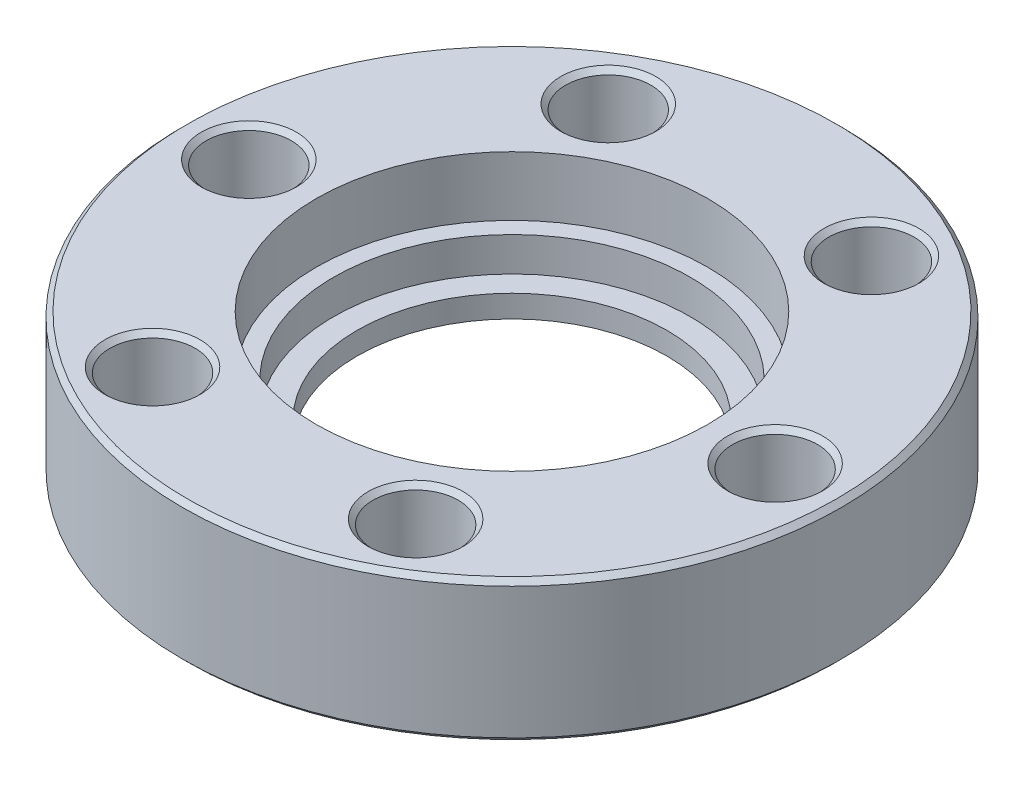
ISO-10303-21;
HEADER;
FILE_DESCRIPTION(('STEP AP214'),'2;1');
FILE_NAME('part.step','',(''),(''),'','','');
FILE_SCHEMA(('AUTOMOTIVE_DESIGN { 1 0 10303 214 1 1 1 1 }'));
ENDSEC;
DATA;
#1=APPLICATION_CONTEXT('core data for automotive mechanical design processes');
#2=APPLICATION_PROTOCOL_DEFINITION('international standard','automotive_design',2000,#1);
#3=PRODUCT_CONTEXT('',#1,'mechanical');
#4=PRODUCT('Part','Part','',(#3));
#5=PRODUCT_RELATED_PRODUCT_CATEGORY('part','',(#4));
#6=PRODUCT_DEFINITION_FORMATION('','',#4);
#7=PRODUCT_DEFINITION_CONTEXT('part definition',#1,'design');
#8=PRODUCT_DEFINITION('design','',#6,#7);
#9=PRODUCT_DEFINITION_SHAPE('','',#8);
#10=(LENGTH_UNIT() NAMED_UNIT(*) SI_UNIT(.MILLI.,.METRE.));
#11=(NAMED_UNIT(*) PLANE_ANGLE_UNIT() SI_UNIT($,.RADIAN.));
#12=(NAMED_UNIT(*) SI_UNIT($,.STERADIAN.) SOLID_ANGLE_UNIT());
#13=UNCERTAINTY_MEASURE_WITH_UNIT(LENGTH_MEASURE(1.E-05),#10,'distance_accuracy_value','');
#14=(GEOMETRIC_REPRESENTATION_CONTEXT(3) GLOBAL_UNCERTAINTY_ASSIGNED_CONTEXT((#13)) GLOBAL_UNIT_ASSIGNED_CONTEXT((#10,
#11,#12)) REPRESENTATION_CONTEXT('',''));
#15=CARTESIAN_POINT('',(0.,0.,0.));
#16=DIRECTION('',(0.,0.,1.));
#17=DIRECTION('',(1.,0.,0.));
#18=AXIS2_PLACEMENT_3D('',#15,#16,#17);
#19=CARTESIAN_POINT('',(0.,10.0543641033815,0.));
#20=DIRECTION('',(0.,1.,0.));
#21=DIRECTION('',(0.,0.,1.));
#22=AXIS2_PLACEMENT_3D('',#19,#20,#21);
#23=CYLINDRICAL_SURFACE('',#22,9.144);
#24=CARTESIAN_POINT('',(0.,1.29540000000001,0.));
#25=DIRECTION('',(0.,1.,0.));
#26=DIRECTION('',(0.,0.,1.));
#27=AXIS2_PLACEMENT_3D('',#24,#25,#26);
#28=CIRCLE('',#27,9.144);
#29=CARTESIAN_POINT('',(0.,1.29540000000001,9.144));
#30=VERTEX_POINT('',#29);
#31=EDGE_CURVE('E17',#30,#30,#28,.F.);
#32=ORIENTED_EDGE('',*,*,#31,.F.);
#33=EDGE_LOOP('',(#32));
#34=FACE_BOUND('',#33,.T.);
#35=CARTESIAN_POINT('',(0.,0.6604,0.));
#36=DIRECTION('',(0.,1.,0.));
#37=DIRECTION('',(0.,0.,1.));
#38=AXIS2_PLACEMENT_3D('',#35,#36,#37);
#39=CIRCLE('',#38,9.144);
#40=CARTESIAN_POINT('',(0.,0.6604,9.144));
#41=VERTEX_POINT('',#40);
#42=EDGE_CURVE('E29',#41,#41,#39,.T.);
#43=ORIENTED_EDGE('',*,*,#42,.F.);
#44=EDGE_LOOP('',(#43));
#45=FACE_BOUND('',#44,.T.);
#46=ADVANCED_FACE('F14',(#34,#45),#23,.F.);
#47=CARTESIAN_POINT('',(9.144,1.29540000000001,0.));
#48=DIRECTION('',(0.,-1.,0.));
#49=DIRECTION('',(0.,0.,-1.));
#50=AXIS2_PLACEMENT_3D('',#47,#48,#49);
#51=PLANE('',#50);
#52=ORIENTED_EDGE('',*,*,#31,.T.);
#53=EDGE_LOOP('',(#52));
#54=FACE_BOUND('',#53,.T.);
#55=CARTESIAN_POINT('',(0.,1.29540000000001,0.));
#56=DIRECTION('',(0.,1.,0.));
#57=DIRECTION('',(0.,0.,1.));
#58=AXIS2_PLACEMENT_3D('',#55,#56,#57);
#59=CIRCLE('',#58,7.9375);
#60=CARTESIAN_POINT('',(0.,1.29540000000001,7.9375));
#61=VERTEX_POINT('',#60);
#62=EDGE_CURVE('E90',#61,#61,#59,.T.);
#63=ORIENTED_EDGE('',*,*,#62,.T.);
#64=EDGE_LOOP('',(#63));
#65=FACE_BOUND('',#64,.T.);
#66=ADVANCED_FACE('F101',(#54,#65),#51,.T.);
#67=CARTESIAN_POINT('',(0.,1.23358032492243,0.));
#68=DIRECTION('',(0.,1.,0.));
#69=DIRECTION('',(0.,0.,1.));
#70=AXIS2_PLACEMENT_3D('',#67,#68,#69);
#71=CONICAL_SURFACE('',#70,10.7188,1.22173047639602);
#72=ORIENTED_EDGE('',*,*,#42,.T.);
#73=EDGE_LOOP('',(#72));
#74=FACE_BOUND('',#73,.T.);
#75=CARTESIAN_POINT('',(0.,1.23358032492243,0.));
#76=DIRECTION('',(0.,1.,0.));
#77=DIRECTION('',(0.,0.,1.));
#78=AXIS2_PLACEMENT_3D('',#75,#76,#77);
#79=CIRCLE('',#78,10.7188);
#80=CARTESIAN_POINT('',(0.,1.23358032492243,10.7188));
#81=VERTEX_POINT('',#80);
#82=EDGE_CURVE('E89',#81,#81,#79,.F.);
#83=ORIENTED_EDGE('',*,*,#82,.T.);
#84=EDGE_LOOP('',(#83));
#85=FACE_BOUND('',#84,.T.);
#86=ADVANCED_FACE('F109',(#74,#85),#71,.T.);
#87=CARTESIAN_POINT('',(0.,0.,0.));
#88=DIRECTION('',(0.,1.,0.));
#89=DIRECTION('',(0.,0.,1.));
#90=AXIS2_PLACEMENT_3D('',#87,#88,#89);
#91=CYLINDRICAL_SURFACE('',#90,7.9375);
#92=ORIENTED_EDGE('',*,*,#62,.F.);
#93=EDGE_LOOP('',(#92));
#94=FACE_BOUND('',#93,.T.);
#95=CARTESIAN_POINT('',(0.,2.4384,0.));
#96=DIRECTION('',(0.,1.,0.));
#97=DIRECTION('',(0.,0.,1.));
#98=AXIS2_PLACEMENT_3D('',#95,#96,#97);
#99=CIRCLE('',#98,7.9375);
#100=CARTESIAN_POINT('',(0.,2.4384,7.9375));
#101=VERTEX_POINT('',#100);
#102=EDGE_CURVE('E87',#101,#101,#99,.F.);
#103=ORIENTED_EDGE('',*,*,#102,.F.);
#104=EDGE_LOOP('',(#103));
#105=FACE_BOUND('',#104,.T.);
#106=ADVANCED_FACE('F224',(#94,#105),#91,.F.);
#107=CARTESIAN_POINT('',(0.,10.0543641033815,0.));
#108=DIRECTION('',(0.,1.,0.));
#109=DIRECTION('',(0.,0.,1.));
#110=AXIS2_PLACEMENT_3D('',#107,#108,#109);
#111=CYLINDRICAL_SURFACE('',#110,10.7188);
#112=ORIENTED_EDGE('',*,*,#82,.F.);
#113=EDGE_LOOP('',(#112));
#114=FACE_BOUND('',#113,.T.);
#115=CARTESIAN_POINT('',(0.,0.,0.));
#116=DIRECTION('',(0.,1.,0.));
#117=DIRECTION('',(0.,0.,1.));
#118=AXIS2_PLACEMENT_3D('',#115,#116,#117);
#119=CIRCLE('',#118,10.7188);
#120=CARTESIAN_POINT('',(0.,0.,10.7188));
#121=VERTEX_POINT('',#120);
#122=EDGE_CURVE('E84',#121,#121,#119,.T.);
#123=ORIENTED_EDGE('',*,*,#122,.F.);
#124=EDGE_LOOP('',(#123));
#125=FACE_BOUND('',#124,.T.);
#126=ADVANCED_FACE('F220',(#114,#125),#111,.F.);
#127=CARTESIAN_POINT('',(0.,2.4384,0.));
#128=DIRECTION('',(0.,1.,0.));
#129=DIRECTION('',(0.,0.,1.));
#130=AXIS2_PLACEMENT_3D('',#127,#128,#129);
#131=PLANE('',#130);
#132=ORIENTED_EDGE('',*,*,#102,.T.);
#133=EDGE_LOOP('',(#132));
#134=FACE_BOUND('',#133,.T.);
#135=CARTESIAN_POINT('',(0.,2.4384,0.));
#136=DIRECTION('',(0.,1.,0.));
#137=DIRECTION('',(0.,0.,1.));
#138=AXIS2_PLACEMENT_3D('',#135,#136,#137);
#139=CIRCLE('',#138,9.144);
#140=CARTESIAN_POINT('',(0.,2.4384,9.144));
#141=VERTEX_POINT('',#140);
#142=EDGE_CURVE('E63',#141,#141,#139,.T.);
#143=ORIENTED_EDGE('',*,*,#142,.T.);
#144=EDGE_LOOP('',(#143));
#145=FACE_BOUND('',#144,.T.);
#146=ADVANCED_FACE('F216',(#134,#145),#131,.T.);
#147=CARTESIAN_POINT('',(0.,0.,0.));
#148=DIRECTION('',(0.,-1.,0.));
#149=DIRECTION('',(0.,0.,-1.));
#150=AXIS2_PLACEMENT_3D('',#147,#148,#149);
#151=PLANE('',#150);
#152=ORIENTED_EDGE('',*,*,#122,.T.);
#153=EDGE_LOOP('',(#152));
#154=FACE_BOUND('',#153,.T.);
#155=CARTESIAN_POINT('',(0.,0.,0.));
#156=DIRECTION('',(0.,1.,0.));
#157=DIRECTION('',(0.,0.,1.));
#158=AXIS2_PLACEMENT_3D('',#155,#156,#157);
#159=CIRCLE('',#158,16.637);
#160=CARTESIAN_POINT('',(0.,0.,16.637));
#161=VERTEX_POINT('',#160);
#162=EDGE_CURVE('E59',#161,#161,#159,.T.);
#163=ORIENTED_EDGE('',*,*,#162,.F.);
#164=EDGE_LOOP('',(#163));
#165=FACE_BOUND('',#164,.T.);
#166=CARTESIAN_POINT('',(6.74370000000014,0.,-11.6804310310022));
#167=DIRECTION('',(0.,-1.,0.));
#168=DIRECTION('',(0.,0.,-1.));
#169=AXIS2_PLACEMENT_3D('',#166,#167,#168);
#170=CIRCLE('',#169,2.43839999999638);
#171=CARTESIAN_POINT('',(6.74370000000014,0.,-14.1188310309985));
#172=VERTEX_POINT('',#171);
#173=EDGE_CURVE('E78',#172,#172,#170,.F.);
#174=ORIENTED_EDGE('',*,*,#173,.T.);
#175=EDGE_LOOP('',(#174));
#176=FACE_BOUND('',#175,.T.);
#177=CARTESIAN_POINT('',(13.4874,-5.6843418860808E-11,0.));
#178=DIRECTION('',(0.,-1.,0.));
#179=DIRECTION('',(0.,0.,-1.));
#180=AXIS2_PLACEMENT_3D('',#177,#178,#179);
#181=CIRCLE('',#180,2.43840000001683);
#182=CARTESIAN_POINT('',(13.4874,-5.6843418860808E-11,-2.43840000001683));
#183=VERTEX_POINT('',#182);
#184=EDGE_CURVE('E75',#183,#183,#181,.F.);
#185=ORIENTED_EDGE('',*,*,#184,.T.);
#186=EDGE_LOOP('',(#185));
#187=FACE_BOUND('',#186,.T.);
#188=CARTESIAN_POINT('',(6.74369999999997,-5.6843418860808E-11,11.6804310310023));
#189=DIRECTION('',(0.,-1.,0.));
#190=DIRECTION('',(0.,0.,-1.));
#191=AXIS2_PLACEMENT_3D('',#188,#189,#190);
#192=CIRCLE('',#191,2.43840000003737);
#193=CARTESIAN_POINT('',(6.74369999999997,-5.6843418860808E-11,9.24203103096488));
#194=VERTEX_POINT('',#193);
#195=EDGE_CURVE('E72',#194,#194,#192,.F.);
#196=ORIENTED_EDGE('',*,*,#195,.T.);
#197=EDGE_LOOP('',(#196));
#198=FACE_BOUND('',#197,.T.);
#199=CARTESIAN_POINT('',(-6.74370000000005,5.6843418860808E-11,11.6804310310022));
#200=DIRECTION('',(0.,-1.,0.));
#201=DIRECTION('',(0.,0.,-1.));
#202=AXIS2_PLACEMENT_3D('',#199,#200,#201);
#203=CIRCLE('',#202,2.43839999998048);
#204=CARTESIAN_POINT('',(-6.74370000000005,5.6843418860808E-11,9.24203103102172));
#205=VERTEX_POINT('',#204);
#206=EDGE_CURVE('E69',#205,#205,#203,.F.);
#207=ORIENTED_EDGE('',*,*,#206,.T.);
#208=EDGE_LOOP('',(#207));
#209=FACE_BOUND('',#208,.T.);
#210=CARTESIAN_POINT('',(-13.4874,-5.6843418860808E-11,0.));
#211=DIRECTION('',(0.,-1.,0.));
#212=DIRECTION('',(0.,0.,-1.));
#213=AXIS2_PLACEMENT_3D('',#210,#211,#212);
#214=CIRCLE('',#213,2.43840000001673);
#215=CARTESIAN_POINT('',(-13.4874,-5.6843418860808E-11,-2.43840000001683));
#216=VERTEX_POINT('',#215);
#217=EDGE_CURVE('E66',#216,#216,#214,.F.);
#218=ORIENTED_EDGE('',*,*,#217,.T.);
#219=EDGE_LOOP('',(#218));
#220=FACE_BOUND('',#219,.T.);
#221=CARTESIAN_POINT('',(-6.74369999999989,5.6843418860808E-11,-11.6804310310023));
#222=DIRECTION('',(0.,-1.,0.));
#223=DIRECTION('',(0.,0.,-1.));
#224=AXIS2_PLACEMENT_3D('',#221,#222,#223);
#225=CIRCLE('',#224,2.43839999993939);
#226=CARTESIAN_POINT('',(-6.74369999999989,5.6843418860808E-11,-14.1188310309417));
#227=VERTEX_POINT('',#226);
#228=EDGE_CURVE('E81',#227,#227,#225,.F.);
#229=ORIENTED_EDGE('',*,*,#228,.T.);
#230=EDGE_LOOP('',(#229));
#231=FACE_BOUND('',#230,.T.);
#232=ADVANCED_FACE('F212',(#154,#165,#176,#187,#198,#209,#220,#231),#151,.T.);
#233=CARTESIAN_POINT('',(-6.74369999999989,1.13686837721616E-10,-11.6804310310023));
#234=DIRECTION('',(0.,-1.,0.));
#235=DIRECTION('',(0.,0.,-1.));
#236=AXIS2_PLACEMENT_3D('',#233,#234,#235);
#237=CONICAL_SURFACE('',#236,2.43839999988255,0.785398163397448);
#238=CARTESIAN_POINT('',(-6.74369999999989,0.254,-11.6804310310023));
#239=DIRECTION('',(0.,1.,0.));
#240=DIRECTION('',(0.,0.,1.));
#241=AXIS2_PLACEMENT_3D('',#238,#239,#240);
#242=CIRCLE('',#241,2.1844);
#243=CARTESIAN_POINT('',(-6.74369999999989,0.254,-9.4960310310023));
#244=VERTEX_POINT('',#243);
#245=EDGE_CURVE('E62',#244,#244,#242,.T.);
#246=ORIENTED_EDGE('',*,*,#245,.T.);
#247=EDGE_LOOP('',(#246));
#248=FACE_BOUND('',#247,.T.);
#249=ORIENTED_EDGE('',*,*,#228,.F.);
#250=EDGE_LOOP('',(#249));
#251=FACE_BOUND('',#250,.T.);
#252=ADVANCED_FACE('F208',(#248,#251),#237,.F.);
#253=CARTESIAN_POINT('',(6.74370000000014,0.,-11.6804310310022));
#254=DIRECTION('',(0.,-1.,0.));
#255=DIRECTION('',(0.,0.,-1.));
#256=AXIS2_PLACEMENT_3D('',#253,#254,#255);
#257=CONICAL_SURFACE('',#256,2.43839999999638,0.785398163397448);
#258=CARTESIAN_POINT('',(6.74370000000014,0.254000000000007,-11.6804310310022));
#259=DIRECTION('',(0.,1.,0.));
#260=DIRECTION('',(0.,0.,1.));
#261=AXIS2_PLACEMENT_3D('',#258,#259,#260);
#262=CIRCLE('',#261,2.1844);
#263=CARTESIAN_POINT('',(6.74370000000014,0.254000000000007,-9.49603103100216));
#264=VERTEX_POINT('',#263);
#265=EDGE_CURVE('E395',#264,#264,#262,.T.);
#266=ORIENTED_EDGE('',*,*,#265,.T.);
#267=EDGE_LOOP('',(#266));
#268=FACE_BOUND('',#267,.T.);
#269=ORIENTED_EDGE('',*,*,#173,.F.);
#270=EDGE_LOOP('',(#269));
#271=FACE_BOUND('',#270,.T.);
#272=ADVANCED_FACE('F204',(#268,#271),#257,.F.);
#273=CARTESIAN_POINT('',(13.4874,5.6843418860808E-11,0.));
#274=DIRECTION('',(0.,-1.,0.));
#275=DIRECTION('',(0.,0.,-1.));
#276=AXIS2_PLACEMENT_3D('',#273,#274,#275);
#277=CONICAL_SURFACE('',#276,2.43839999990314,0.785398163397448);
#278=CARTESIAN_POINT('',(13.4874,0.253999999999999,0.));
#279=DIRECTION('',(0.,1.,0.));
#280=DIRECTION('',(0.,0.,1.));
#281=AXIS2_PLACEMENT_3D('',#278,#279,#280);
#282=CIRCLE('',#281,2.1844);
#283=CARTESIAN_POINT('',(13.4874,0.253999999999999,2.1844));
#284=VERTEX_POINT('',#283);
#285=EDGE_CURVE('E398',#284,#284,#282,.T.);
#286=ORIENTED_EDGE('',*,*,#285,.T.);
#287=EDGE_LOOP('',(#286));
#288=FACE_BOUND('',#287,.T.);
#289=ORIENTED_EDGE('',*,*,#184,.F.);
#290=EDGE_LOOP('',(#289));
#291=FACE_BOUND('',#290,.T.);
#292=ADVANCED_FACE('F200',(#288,#291),#277,.F.);
#293=CARTESIAN_POINT('',(6.74369999999997,-1.13686837721616E-10,11.6804310310023));
#294=DIRECTION('',(0.,-1.,0.));
#295=DIRECTION('',(0.,0.,-1.));
#296=AXIS2_PLACEMENT_3D('',#293,#294,#295);
#297=CONICAL_SURFACE('',#296,2.43840000009422,0.785398163397448);
#298=CARTESIAN_POINT('',(6.74369999999997,0.253999999999986,11.6804310310023));
#299=DIRECTION('',(0.,1.,0.));
#300=DIRECTION('',(0.,0.,1.));
#301=AXIS2_PLACEMENT_3D('',#298,#299,#300);
#302=CIRCLE('',#301,2.1844);
#303=CARTESIAN_POINT('',(6.74369999999997,0.253999999999986,13.8648310310023));
#304=VERTEX_POINT('',#303);
#305=EDGE_CURVE('E403',#304,#304,#302,.T.);
#306=ORIENTED_EDGE('',*,*,#305,.T.);
#307=EDGE_LOOP('',(#306));
#308=FACE_BOUND('',#307,.T.);
#309=ORIENTED_EDGE('',*,*,#195,.F.);
#310=EDGE_LOOP('',(#309));
#311=FACE_BOUND('',#310,.T.);
#312=ADVANCED_FACE('F196',(#308,#311),#297,.F.);
#313=CARTESIAN_POINT('',(-6.74370000000005,1.13686837721616E-10,11.6804310310022));
#314=DIRECTION('',(0.,-1.,0.));
#315=DIRECTION('',(0.,0.,-1.));
#316=AXIS2_PLACEMENT_3D('',#313,#314,#315);
#317=CONICAL_SURFACE('',#316,2.43839999992364,0.785398163397448);
#318=CARTESIAN_POINT('',(-6.74370000000005,0.253999999999987,11.6804310310022));
#319=DIRECTION('',(0.,1.,0.));
#320=DIRECTION('',(0.,0.,1.));
#321=AXIS2_PLACEMENT_3D('',#318,#319,#320);
#322=CIRCLE('',#321,2.1844);
#323=CARTESIAN_POINT('',(-6.74370000000005,0.253999999999987,13.8648310310022));
#324=VERTEX_POINT('',#323);
#325=EDGE_CURVE('E406',#324,#324,#322,.T.);
#326=ORIENTED_EDGE('',*,*,#325,.T.);
#327=EDGE_LOOP('',(#326));
#328=FACE_BOUND('',#327,.T.);
#329=ORIENTED_EDGE('',*,*,#206,.F.);
#330=EDGE_LOOP('',(#329));
#331=FACE_BOUND('',#330,.T.);
#332=ADVANCED_FACE('F192',(#328,#331),#317,.F.);
#333=CARTESIAN_POINT('',(-13.4874,5.6843418860808E-11,0.));
#334=DIRECTION('',(0.,-1.,0.));
#335=DIRECTION('',(0.,0.,-1.));
#336=AXIS2_PLACEMENT_3D('',#333,#334,#335);
#337=CONICAL_SURFACE('',#336,2.43839999990305,0.785398163397448);
#338=CARTESIAN_POINT('',(-13.4874,0.253999999999999,0.));
#339=DIRECTION('',(0.,1.,0.));
#340=DIRECTION('',(0.,0.,1.));
#341=AXIS2_PLACEMENT_3D('',#338,#339,#340);
#342=CIRCLE('',#341,2.1844);
#343=CARTESIAN_POINT('',(-13.4874,0.253999999999999,2.18439999999991));
#344=VERTEX_POINT('',#343);
#345=EDGE_CURVE('E58',#344,#344,#342,.T.);
#346=ORIENTED_EDGE('',*,*,#345,.T.);
#347=EDGE_LOOP('',(#346));
#348=FACE_BOUND('',#347,.T.);
#349=ORIENTED_EDGE('',*,*,#217,.F.);
#350=EDGE_LOOP('',(#349));
#351=FACE_BOUND('',#350,.T.);
#352=ADVANCED_FACE('F188',(#348,#351),#337,.F.);
#353=CARTESIAN_POINT('',(0.,2.4384,0.));
#354=DIRECTION('',(0.,1.,0.));
#355=DIRECTION('',(0.,0.,1.));
#356=AXIS2_PLACEMENT_3D('',#353,#354,#355);
#357=CYLINDRICAL_SURFACE('',#356,9.144);
#358=ORIENTED_EDGE('',*,*,#142,.F.);
#359=EDGE_LOOP('',(#358));
#360=FACE_BOUND('',#359,.T.);
#361=CARTESIAN_POINT('',(0.,4.191,0.));
#362=DIRECTION('',(0.,1.,0.));
#363=DIRECTION('',(0.,0.,1.));
#364=AXIS2_PLACEMENT_3D('',#361,#362,#363);
#365=CIRCLE('',#364,9.144);
#366=CARTESIAN_POINT('',(0.,4.191,9.144));
#367=VERTEX_POINT('',#366);
#368=EDGE_CURVE('E54',#367,#367,#365,.F.);
#369=ORIENTED_EDGE('',*,*,#368,.F.);
#370=EDGE_LOOP('',(#369));
#371=FACE_BOUND('',#370,.T.);
#372=ADVANCED_FACE('F184',(#360,#371),#357,.F.);
#373=CARTESIAN_POINT('',(0.,0.254000000000004,0.));
#374=DIRECTION('',(0.,1.,0.));
#375=DIRECTION('',(0.,0.,1.));
#376=AXIS2_PLACEMENT_3D('',#373,#374,#375);
#377=CONICAL_SURFACE('',#376,16.891,0.785398163397449);
#378=CARTESIAN_POINT('',(0.,0.254000000000004,0.));
#379=DIRECTION('',(0.,1.,0.));
#380=DIRECTION('',(0.,0.,1.));
#381=AXIS2_PLACEMENT_3D('',#378,#379,#380);
#382=CIRCLE('',#381,16.891);
#383=CARTESIAN_POINT('',(0.,0.254000000000004,16.891));
#384=VERTEX_POINT('',#383);
#385=EDGE_CURVE('E57',#384,#384,#382,.T.);
#386=ORIENTED_EDGE('',*,*,#385,.F.);
#387=EDGE_LOOP('',(#386));
#388=FACE_BOUND('',#387,.T.);
#389=ORIENTED_EDGE('',*,*,#162,.T.);
#390=EDGE_LOOP('',(#389));
#391=FACE_BOUND('',#390,.T.);
#392=ADVANCED_FACE('F180',(#388,#391),#377,.T.);
#393=CARTESIAN_POINT('',(-6.74369999999989,0.,-11.6804310310023));
#394=DIRECTION('',(0.,1.,0.));
#395=DIRECTION('',(0.,0.,1.));
#396=AXIS2_PLACEMENT_3D('',#393,#394,#395);
#397=CYLINDRICAL_SURFACE('',#396,2.1844);
#398=ORIENTED_EDGE('',*,*,#245,.F.);
#399=EDGE_LOOP('',(#398));
#400=FACE_BOUND('',#399,.T.);
#401=CARTESIAN_POINT('',(-6.74369999999989,6.98499999998603,-11.6804310310023));
#402=DIRECTION('',(0.,1.,0.));
#403=DIRECTION('',(0.,0.,1.));
#404=AXIS2_PLACEMENT_3D('',#401,#402,#403);
#405=CIRCLE('',#404,2.18439999999659);
#406=CARTESIAN_POINT('',(-6.74369999999989,6.98499999998603,-9.49603103100571));
#407=VERTEX_POINT('',#406);
#408=EDGE_CURVE('E413',#407,#407,#405,.T.);
#409=ORIENTED_EDGE('',*,*,#408,.T.);
#410=EDGE_LOOP('',(#409));
#411=FACE_BOUND('',#410,.T.);
#412=ADVANCED_FACE('F176',(#400,#411),#397,.F.);
#413=CARTESIAN_POINT('',(6.74370000000014,0.,-11.6804310310022));
#414=DIRECTION('',(0.,1.,0.));
#415=DIRECTION('',(0.,0.,1.));
#416=AXIS2_PLACEMENT_3D('',#413,#414,#415);
#417=CYLINDRICAL_SURFACE('',#416,2.1844);
#418=ORIENTED_EDGE('',*,*,#265,.F.);
#419=EDGE_LOOP('',(#418));
#420=FACE_BOUND('',#419,.T.);
#421=CARTESIAN_POINT('',(6.74370000000014,6.98499999998603,-11.6804310310022));
#422=DIRECTION('',(0.,1.,0.));
#423=DIRECTION('',(0.,0.,1.));
#424=AXIS2_PLACEMENT_3D('',#421,#422,#423);
#425=CIRCLE('',#424,2.18439999999645);
#426=CARTESIAN_POINT('',(6.74370000000014,6.98499999998603,-9.49603103100571));
#427=VERTEX_POINT('',#426);
#428=EDGE_CURVE('E416',#427,#427,#425,.T.);
#429=ORIENTED_EDGE('',*,*,#428,.T.);
#430=EDGE_LOOP('',(#429));
#431=FACE_BOUND('',#430,.T.);
#432=ADVANCED_FACE('F172',(#420,#431),#417,.F.);
#433=CARTESIAN_POINT('',(13.4874,0.,0.));
#434=DIRECTION('',(0.,1.,0.));
#435=DIRECTION('',(0.,0.,1.));
#436=AXIS2_PLACEMENT_3D('',#433,#434,#435);
#437=CYLINDRICAL_SURFACE('',#436,2.1844);
#438=ORIENTED_EDGE('',*,*,#285,.F.);
#439=EDGE_LOOP('',(#438));
#440=FACE_BOUND('',#439,.T.);
#441=CARTESIAN_POINT('',(13.4874,6.98499999998603,0.));
#442=DIRECTION('',(0.,1.,0.));
#443=DIRECTION('',(0.,0.,1.));
#444=AXIS2_PLACEMENT_3D('',#441,#442,#443);
#445=CIRCLE('',#444,2.18439999991915);
#446=CARTESIAN_POINT('',(13.4874,6.98499999998603,2.18439999991915));
#447=VERTEX_POINT('',#446);
#448=EDGE_CURVE('E419',#447,#447,#445,.T.);
#449=ORIENTED_EDGE('',*,*,#448,.T.);
#450=EDGE_LOOP('',(#449));
#451=FACE_BOUND('',#450,.T.);
#452=ADVANCED_FACE('F168',(#440,#451),#437,.F.);
#453=CARTESIAN_POINT('',(6.74369999999997,0.,11.6804310310023));
#454=DIRECTION('',(0.,1.,0.));
#455=DIRECTION('',(0.,0.,1.));
#456=AXIS2_PLACEMENT_3D('',#453,#454,#455);
#457=CYLINDRICAL_SURFACE('',#456,2.1844);
#458=ORIENTED_EDGE('',*,*,#305,.F.);
#459=EDGE_LOOP('',(#458));
#460=FACE_BOUND('',#459,.T.);
#461=CARTESIAN_POINT('',(6.74369999999997,6.98499999998603,11.6804310310023));
#462=DIRECTION('',(0.,1.,0.));
#463=DIRECTION('',(0.,0.,1.));
#464=AXIS2_PLACEMENT_3D('',#461,#462,#463);
#465=CIRCLE('',#464,2.18440000001229);
#466=CARTESIAN_POINT('',(6.74369999999997,6.98499999998603,13.8648310310145));
#467=VERTEX_POINT('',#466);
#468=EDGE_CURVE('E422',#467,#467,#465,.T.);
#469=ORIENTED_EDGE('',*,*,#468,.T.);
#470=EDGE_LOOP('',(#469));
#471=FACE_BOUND('',#470,.T.);
#472=ADVANCED_FACE('F164',(#460,#471),#457,.F.);
#473=CARTESIAN_POINT('',(-6.74370000000005,0.,11.6804310310022));
#474=DIRECTION('',(0.,1.,0.));
#475=DIRECTION('',(0.,0.,1.));
#476=AXIS2_PLACEMENT_3D('',#473,#474,#475);
#477=CYLINDRICAL_SURFACE('',#476,2.1844);
#478=ORIENTED_EDGE('',*,*,#325,.F.);
#479=EDGE_LOOP('',(#478));
#480=FACE_BOUND('',#479,.T.);
#481=CARTESIAN_POINT('',(-6.74370000000005,6.98499999998603,11.6804310310022));
#482=DIRECTION('',(0.,1.,0.));
#483=DIRECTION('',(0.,0.,1.));
#484=AXIS2_PLACEMENT_3D('',#481,#482,#483);
#485=CIRCLE('',#484,2.18440000001234);
#486=CARTESIAN_POINT('',(-6.74370000000005,6.98499999998603,13.8648310310145));
#487=VERTEX_POINT('',#486);
#488=EDGE_CURVE('E425',#487,#487,#485,.T.);
#489=ORIENTED_EDGE('',*,*,#488,.T.);
#490=EDGE_LOOP('',(#489));
#491=FACE_BOUND('',#490,.T.);
#492=ADVANCED_FACE('F160',(#480,#491),#477,.F.);
#493=CARTESIAN_POINT('',(-13.4874,0.,0.));
#494=DIRECTION('',(0.,1.,0.));
#495=DIRECTION('',(0.,0.,1.));
#496=AXIS2_PLACEMENT_3D('',#493,#494,#495);
#497=CYLINDRICAL_SURFACE('',#496,2.1844);
#498=ORIENTED_EDGE('',*,*,#345,.F.);
#499=EDGE_LOOP('',(#498));
#500=FACE_BOUND('',#499,.T.);
#501=CARTESIAN_POINT('',(-13.4874,6.98499999998603,0.));
#502=DIRECTION('',(0.,1.,0.));
#503=DIRECTION('',(0.,0.,1.));
#504=AXIS2_PLACEMENT_3D('',#501,#502,#503);
#505=CIRCLE('',#504,2.18439999991925);
#506=CARTESIAN_POINT('',(-13.4874,6.98499999998603,2.18439999991915));
#507=VERTEX_POINT('',#506);
#508=EDGE_CURVE('E53',#507,#507,#505,.T.);
#509=ORIENTED_EDGE('',*,*,#508,.T.);
#510=EDGE_LOOP('',(#509));
#511=FACE_BOUND('',#510,.T.);
#512=ADVANCED_FACE('F156',(#500,#511),#497,.F.);
#513=CARTESIAN_POINT('',(0.,4.191,0.));
#514=DIRECTION('',(0.,1.,0.));
#515=DIRECTION('',(0.,0.,1.));
#516=AXIS2_PLACEMENT_3D('',#513,#514,#515);
#517=PLANE('',#516);
#518=ORIENTED_EDGE('',*,*,#368,.T.);
#519=EDGE_LOOP('',(#518));
#520=FACE_BOUND('',#519,.T.);
#521=CARTESIAN_POINT('',(0.,4.191,0.));
#522=DIRECTION('',(0.,1.,0.));
#523=DIRECTION('',(0.,0.,1.));
#524=AXIS2_PLACEMENT_3D('',#521,#522,#523);
#525=CIRCLE('',#524,10.033);
#526=CARTESIAN_POINT('',(0.,4.191,10.033));
#527=VERTEX_POINT('',#526);
#528=EDGE_CURVE('E50',#527,#527,#525,.T.);
#529=ORIENTED_EDGE('',*,*,#528,.T.);
#530=EDGE_LOOP('',(#529));
#531=FACE_BOUND('',#530,.T.);
#532=ADVANCED_FACE('F152',(#520,#531),#517,.T.);
#533=CARTESIAN_POINT('',(0.,43.9057142857143,0.));
#534=DIRECTION('',(0.,1.,0.));
#535=DIRECTION('',(0.,0.,1.));
#536=AXIS2_PLACEMENT_3D('',#533,#534,#535);
#537=CYLINDRICAL_SURFACE('',#536,16.891);
#538=CARTESIAN_POINT('',(0.,6.985,0.));
#539=DIRECTION('',(0.,-1.,0.));
#540=DIRECTION('',(0.,0.,-1.));
#541=AXIS2_PLACEMENT_3D('',#538,#539,#540);
#542=CIRCLE('',#541,16.891);
#543=CARTESIAN_POINT('',(0.,6.985,-16.891));
#544=VERTEX_POINT('',#543);
#545=EDGE_CURVE('E49',#544,#544,#542,.F.);
#546=ORIENTED_EDGE('',*,*,#545,.F.);
#547=EDGE_LOOP('',(#546));
#548=FACE_BOUND('',#547,.T.);
#549=ORIENTED_EDGE('',*,*,#385,.T.);
#550=EDGE_LOOP('',(#549));
#551=FACE_BOUND('',#550,.T.);
#552=ADVANCED_FACE('F148',(#548,#551),#537,.T.);
#553=CARTESIAN_POINT('',(-6.74369999999989,7.23899999985633,-11.6804310310023));
#554=DIRECTION('',(0.,1.,0.));
#555=DIRECTION('',(-1.,0.,0.));
#556=AXIS2_PLACEMENT_3D('',#553,#554,#555);
#557=CONICAL_SURFACE('',#556,2.43839999992373,0.785398163397448);
#558=ORIENTED_EDGE('',*,*,#408,.F.);
#559=EDGE_LOOP('',(#558));
#560=FACE_BOUND('',#559,.T.);
#561=CARTESIAN_POINT('',(-6.74369999999989,7.23899999997002,-11.6804310310023));
#562=DIRECTION('',(0.,1.,0.));
#563=DIRECTION('',(-1.,0.,0.));
#564=AXIS2_PLACEMENT_3D('',#561,#562,#563);
#565=CIRCLE('',#564,2.43840000003742);
#566=CARTESIAN_POINT('',(-9.18210000003731,7.23899999997002,-11.6804310310023));
#567=VERTEX_POINT('',#566);
#568=EDGE_CURVE('E46',#567,#567,#565,.F.);
#569=ORIENTED_EDGE('',*,*,#568,.F.);
#570=EDGE_LOOP('',(#569));
#571=FACE_BOUND('',#570,.T.);
#572=ADVANCED_FACE('F144',(#560,#571),#557,.F.);
#573=CARTESIAN_POINT('',(6.74370000000014,7.23899999997002,-11.6804310310022));
#574=DIRECTION('',(0.,1.,0.));
#575=DIRECTION('',(0.,0.,1.));
#576=AXIS2_PLACEMENT_3D('',#573,#574,#575);
#577=CONICAL_SURFACE('',#576,2.43839999998043,0.785398163397448);
#578=ORIENTED_EDGE('',*,*,#428,.F.);
#579=EDGE_LOOP('',(#578));
#580=FACE_BOUND('',#579,.T.);
#581=CARTESIAN_POINT('',(6.74370000000014,7.23900000002686,-11.6804310310022));
#582=DIRECTION('',(0.,1.,0.));
#583=DIRECTION('',(0.,0.,1.));
#584=AXIS2_PLACEMENT_3D('',#581,#582,#583);
#585=CIRCLE('',#584,2.43840000003728);
#586=CARTESIAN_POINT('',(6.74370000000014,7.23900000002686,-9.24203103096488));
#587=VERTEX_POINT('',#586);
#588=EDGE_CURVE('E43',#587,#587,#585,.F.);
#589=ORIENTED_EDGE('',*,*,#588,.F.);
#590=EDGE_LOOP('',(#589));
#591=FACE_BOUND('',#590,.T.);
#592=ADVANCED_FACE('F140',(#580,#591),#577,.F.);
#593=CARTESIAN_POINT('',(13.4874,7.23899999997002,0.));
#594=DIRECTION('',(0.,1.,0.));
#595=DIRECTION('',(0.,0.,1.));
#596=AXIS2_PLACEMENT_3D('',#593,#594,#595);
#597=CONICAL_SURFACE('',#596,2.43839999990314,0.785398163509345);
#598=ORIENTED_EDGE('',*,*,#448,.F.);
#599=EDGE_LOOP('',(#598));
#600=FACE_BOUND('',#599,.T.);
#601=CARTESIAN_POINT('',(13.4874,7.23900000002686,0.));
#602=DIRECTION('',(0.,1.,0.));
#603=DIRECTION('',(0.,0.,1.));
#604=AXIS2_PLACEMENT_3D('',#601,#602,#603);
#605=CIRCLE('',#604,2.43839999995998);
#606=CARTESIAN_POINT('',(13.4874,7.23900000002686,2.43839999995998));
#607=VERTEX_POINT('',#606);
#608=EDGE_CURVE('E40',#607,#607,#605,.F.);
#609=ORIENTED_EDGE('',*,*,#608,.F.);
#610=EDGE_LOOP('',(#609));
#611=FACE_BOUND('',#610,.T.);
#612=ADVANCED_FACE('F136',(#600,#611),#597,.F.);
#613=CARTESIAN_POINT('',(6.74369999999997,7.23899999991318,11.6804310310023));
#614=DIRECTION('',(0.,1.,0.));
#615=DIRECTION('',(0.,0.,1.));
#616=AXIS2_PLACEMENT_3D('',#613,#614,#615);
#617=CONICAL_SURFACE('',#616,2.43839999993944,0.785398163397448);
#618=ORIENTED_EDGE('',*,*,#468,.F.);
#619=EDGE_LOOP('',(#618));
#620=FACE_BOUND('',#619,.T.);
#621=CARTESIAN_POINT('',(6.74369999999997,7.23899999997002,11.6804310310023));
#622=DIRECTION('',(0.,1.,0.));
#623=DIRECTION('',(0.,0.,1.));
#624=AXIS2_PLACEMENT_3D('',#621,#622,#623);
#625=CIRCLE('',#624,2.43839999999628);
#626=CARTESIAN_POINT('',(6.74369999999997,7.23899999997002,14.1188310309985));
#627=VERTEX_POINT('',#626);
#628=EDGE_CURVE('E37',#627,#627,#625,.F.);
#629=ORIENTED_EDGE('',*,*,#628,.F.);
#630=EDGE_LOOP('',(#629));
#631=FACE_BOUND('',#630,.T.);
#632=ADVANCED_FACE('F132',(#620,#631),#617,.F.);
#633=CARTESIAN_POINT('',(-6.74370000000005,7.23900000002686,11.6804310310022));
#634=DIRECTION('',(0.,1.,0.));
#635=DIRECTION('',(-1.,0.,0.));
#636=AXIS2_PLACEMENT_3D('',#633,#634,#635);
#637=CONICAL_SURFACE('',#636,2.43840000005317,0.785398163397448);
#638=ORIENTED_EDGE('',*,*,#488,.F.);
#639=EDGE_LOOP('',(#638));
#640=FACE_BOUND('',#639,.T.);
#641=CARTESIAN_POINT('',(-6.74370000000005,7.23900000002686,11.6804310310022));
#642=DIRECTION('',(0.,1.,0.));
#643=DIRECTION('',(-1.,0.,0.));
#644=AXIS2_PLACEMENT_3D('',#641,#642,#643);
#645=CIRCLE('',#644,2.43840000005317);
#646=CARTESIAN_POINT('',(-9.18210000005322,7.23900000002686,11.6804310310022));
#647=VERTEX_POINT('',#646);
#648=EDGE_CURVE('E34',#647,#647,#645,.F.);
#649=ORIENTED_EDGE('',*,*,#648,.F.);
#650=EDGE_LOOP('',(#649));
#651=FACE_BOUND('',#650,.T.);
#652=ADVANCED_FACE('F128',(#640,#651),#637,.F.);
#653=CARTESIAN_POINT('',(-13.4874,7.23899999997002,0.));
#654=DIRECTION('',(0.,1.,0.));
#655=DIRECTION('',(0.,0.,1.));
#656=AXIS2_PLACEMENT_3D('',#653,#654,#655);
#657=CONICAL_SURFACE('',#656,2.43839999990323,0.785398163509345);
#658=ORIENTED_EDGE('',*,*,#508,.F.);
#659=EDGE_LOOP('',(#658));
#660=FACE_BOUND('',#659,.T.);
#661=CARTESIAN_POINT('',(-13.4874,7.23900000002677,0.));
#662=DIRECTION('',(0.,1.,0.));
#663=DIRECTION('',(0.,0.,1.));
#664=AXIS2_PLACEMENT_3D('',#661,#662,#663);
#665=CIRCLE('',#664,2.43839999995998);
#666=CARTESIAN_POINT('',(-13.4874,7.23900000002677,2.43839999995989));
#667=VERTEX_POINT('',#666);
#668=EDGE_CURVE('E26',#667,#667,#665,.F.);
#669=ORIENTED_EDGE('',*,*,#668,.F.);
#670=EDGE_LOOP('',(#669));
#671=FACE_BOUND('',#670,.T.);
#672=ADVANCED_FACE('F124',(#660,#671),#657,.F.);
#673=CARTESIAN_POINT('',(0.,4.191,0.));
#674=DIRECTION('',(0.,1.,0.));
#675=DIRECTION('',(0.,0.,1.));
#676=AXIS2_PLACEMENT_3D('',#673,#674,#675);
#677=CYLINDRICAL_SURFACE('',#676,10.033);
#678=CARTESIAN_POINT('',(0.,7.239,0.));
#679=DIRECTION('',(0.,1.,0.));
#680=DIRECTION('',(0.,0.,1.));
#681=AXIS2_PLACEMENT_3D('',#678,#679,#680);
#682=CIRCLE('',#681,10.033);
#683=CARTESIAN_POINT('',(0.,7.239,10.033));
#684=VERTEX_POINT('',#683);
#685=EDGE_CURVE('E21',#684,#684,#682,.F.);
#686=ORIENTED_EDGE('',*,*,#685,.F.);
#687=EDGE_LOOP('',(#686));
#688=FACE_BOUND('',#687,.T.);
#689=ORIENTED_EDGE('',*,*,#528,.F.);
#690=EDGE_LOOP('',(#689));
#691=FACE_BOUND('',#690,.T.);
#692=ADVANCED_FACE('F117',(#688,#691),#677,.F.);
#693=CARTESIAN_POINT('',(0.,6.985,0.));
#694=DIRECTION('',(0.,-1.,0.));
#695=DIRECTION('',(1.,0.,0.));
#696=AXIS2_PLACEMENT_3D('',#693,#694,#695);
#697=CONICAL_SURFACE('',#696,16.891,0.785398163397457);
#698=ORIENTED_EDGE('',*,*,#545,.T.);
#699=EDGE_LOOP('',(#698));
#700=FACE_BOUND('',#699,.T.);
#701=CARTESIAN_POINT('',(0.,7.23899999999999,0.));
#702=DIRECTION('',(0.,-1.,0.));
#703=DIRECTION('',(1.,0.,0.));
#704=AXIS2_PLACEMENT_3D('',#701,#702,#703);
#705=CIRCLE('',#704,16.637);
#706=CARTESIAN_POINT('',(16.637,7.23899999999999,0.));
#707=VERTEX_POINT('',#706);
#708=EDGE_CURVE('E10',#707,#707,#705,.F.);
#709=ORIENTED_EDGE('',*,*,#708,.F.);
#710=EDGE_LOOP('',(#709));
#711=FACE_BOUND('',#710,.T.);
#712=ADVANCED_FACE('F112',(#700,#711),#697,.T.);
#713=CARTESIAN_POINT('',(-16.891,7.239,0.));
#714=DIRECTION('',(0.,1.,0.));
#715=DIRECTION('',(0.,0.,1.));
#716=AXIS2_PLACEMENT_3D('',#713,#714,#715);
#717=PLANE('',#716);
#718=ORIENTED_EDGE('',*,*,#708,.T.);
#719=EDGE_LOOP('',(#718));
#720=FACE_BOUND('',#719,.T.);
#721=ORIENTED_EDGE('',*,*,#685,.T.);
#722=EDGE_LOOP('',(#721));
#723=FACE_BOUND('',#722,.T.);
#724=ORIENTED_EDGE('',*,*,#668,.T.);
#725=EDGE_LOOP('',(#724));
#726=FACE_BOUND('',#725,.T.);
#727=ORIENTED_EDGE('',*,*,#648,.T.);
#728=EDGE_LOOP('',(#727));
#729=FACE_BOUND('',#728,.T.);
#730=ORIENTED_EDGE('',*,*,#628,.T.);
#731=EDGE_LOOP('',(#730));
#732=FACE_BOUND('',#731,.T.);
#733=ORIENTED_EDGE('',*,*,#608,.T.);
#734=EDGE_LOOP('',(#733));
#735=FACE_BOUND('',#734,.T.);
#736=ORIENTED_EDGE('',*,*,#588,.T.);
#737=EDGE_LOOP('',(#736));
#738=FACE_BOUND('',#737,.T.);
#739=ORIENTED_EDGE('',*,*,#568,.T.);
#740=EDGE_LOOP('',(#739));
#741=FACE_BOUND('',#740,.T.);
#742=ADVANCED_FACE('F110',(#720,#723,#726,#729,#732,#735,#738,#741),#717,.T.);
#743=CLOSED_SHELL('',(#46,#66,#86,#106,#126,#146,#232,#252,#272,#292,#312,#332,#352,#372,#392,
#412,#432,#452,#472,#492,#512,#532,#552,#572,#592,#612,#632,#652,#672,#692,#712,#742));
#744=MANIFOLD_SOLID_BREP('B1',#743);
#745=ADVANCED_BREP_SHAPE_REPRESENTATION('',(#18,#744),#14);
#746=SHAPE_DEFINITION_REPRESENTATION(#9,#745);
ENDSEC;
END-ISO-10303-21;
